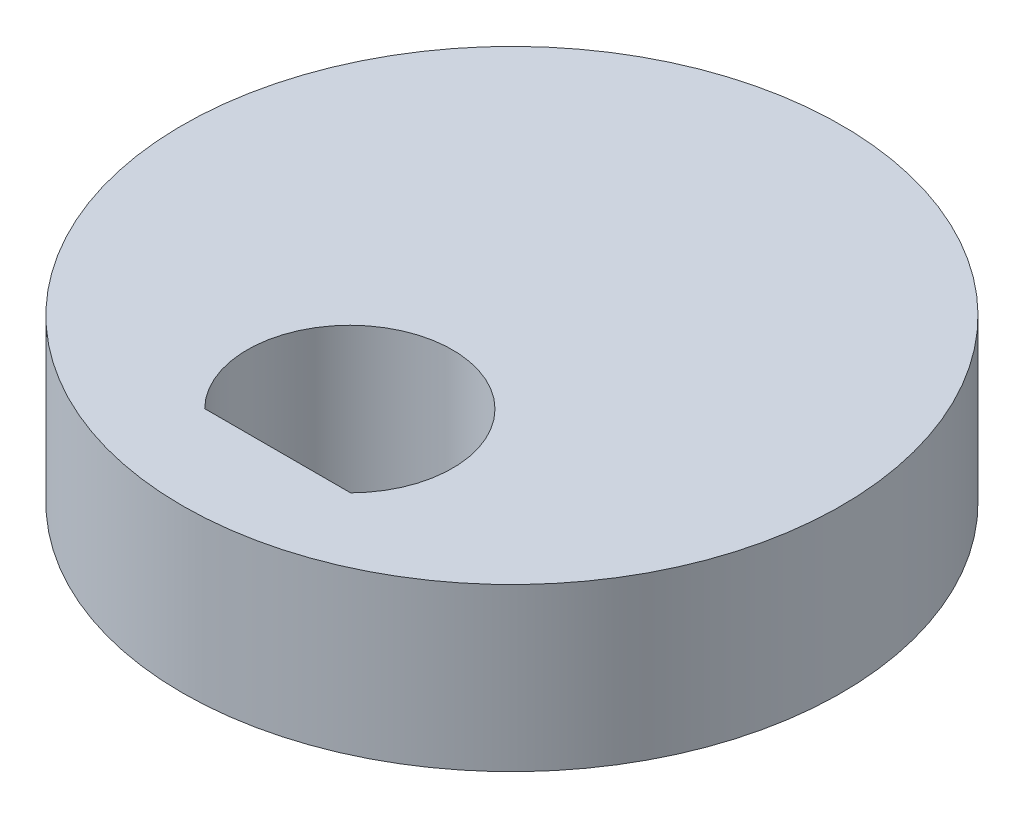
ISO-10303-21;
HEADER;
FILE_DESCRIPTION(('STEP AP214'),'2;1');
FILE_NAME('part.step','',(''),(''),'','','');
FILE_SCHEMA(('AUTOMOTIVE_DESIGN { 1 0 10303 214 1 1 1 1 }'));
ENDSEC;
DATA;
#1=APPLICATION_CONTEXT('core data for automotive mechanical design processes');
#2=APPLICATION_PROTOCOL_DEFINITION('international standard','automotive_design',2000,#1);
#3=PRODUCT_CONTEXT('',#1,'mechanical');
#4=PRODUCT('Part','Part','',(#3));
#5=PRODUCT_RELATED_PRODUCT_CATEGORY('part','',(#4));
#6=PRODUCT_DEFINITION_FORMATION('','',#4);
#7=PRODUCT_DEFINITION_CONTEXT('part definition',#1,'design');
#8=PRODUCT_DEFINITION('design','',#6,#7);
#9=PRODUCT_DEFINITION_SHAPE('','',#8);
#10=(LENGTH_UNIT() NAMED_UNIT(*) SI_UNIT(.MILLI.,.METRE.));
#11=(NAMED_UNIT(*) PLANE_ANGLE_UNIT() SI_UNIT($,.RADIAN.));
#12=(NAMED_UNIT(*) SI_UNIT($,.STERADIAN.) SOLID_ANGLE_UNIT());
#13=UNCERTAINTY_MEASURE_WITH_UNIT(LENGTH_MEASURE(1.E-05),#10,'distance_accuracy_value','');
#14=(GEOMETRIC_REPRESENTATION_CONTEXT(3) GLOBAL_UNCERTAINTY_ASSIGNED_CONTEXT((#13)) GLOBAL_UNIT_ASSIGNED_CONTEXT((#10,
#11,#12)) REPRESENTATION_CONTEXT('',''));
#15=CARTESIAN_POINT('',(0.,0.,0.));
#16=DIRECTION('',(0.,0.,1.));
#17=DIRECTION('',(1.,0.,0.));
#18=AXIS2_PLACEMENT_3D('',#15,#16,#17);
#19=CARTESIAN_POINT('',(0.,3.,0.));
#20=DIRECTION('',(0.,1.,0.));
#21=DIRECTION('',(0.,0.,1.));
#22=AXIS2_PLACEMENT_3D('',#19,#20,#21);
#23=PLANE('',#22);
#24=CARTESIAN_POINT('',(0.,3.,0.));
#25=DIRECTION('',(0.,1.,0.));
#26=DIRECTION('',(0.,0.,1.));
#27=AXIS2_PLACEMENT_3D('',#24,#25,#26);
#28=CIRCLE('',#27,6.1);
#29=CARTESIAN_POINT('',(0.,3.,6.1));
#30=VERTEX_POINT('',#29);
#31=EDGE_CURVE('E11',#30,#30,#28,.T.);
#32=ORIENTED_EDGE('',*,*,#31,.T.);
#33=EDGE_LOOP('',(#32));
#34=FACE_BOUND('',#33,.T.);
#35=DIRECTION('',(1.,0.,0.));
#36=VECTOR('',#35,1.);
#37=CARTESIAN_POINT('',(1.35,3.,4.33697419571209));
#38=LINE('',#37,#36);
#39=CARTESIAN_POINT('',(-1.35,3.,4.33697419571209));
#40=VERTEX_POINT('',#39);
#41=CARTESIAN_POINT('',(1.35,3.,4.33697419571209));
#42=VERTEX_POINT('',#41);
#43=EDGE_CURVE('E89',#40,#42,#38,.T.);
#44=ORIENTED_EDGE('',*,*,#43,.F.);
#45=CARTESIAN_POINT('',(0.,3.,3.));
#46=DIRECTION('',(0.,1.,0.));
#47=DIRECTION('',(0.,0.,1.));
#48=AXIS2_PLACEMENT_3D('',#45,#46,#47);
#49=CIRCLE('',#48,1.9);
#50=EDGE_CURVE('E78',#42,#40,#49,.T.);
#51=ORIENTED_EDGE('',*,*,#50,.F.);
#52=EDGE_LOOP('',(#44,#51));
#53=FACE_BOUND('',#52,.T.);
#54=ADVANCED_FACE('F44',(#34,#53),#23,.T.);
#55=CARTESIAN_POINT('',(0.,0.,0.));
#56=DIRECTION('',(0.,1.,0.));
#57=DIRECTION('',(0.,0.,1.));
#58=AXIS2_PLACEMENT_3D('',#55,#56,#57);
#59=PLANE('',#58);
#60=CARTESIAN_POINT('',(0.,0.,0.));
#61=DIRECTION('',(0.,1.,0.));
#62=DIRECTION('',(0.,0.,1.));
#63=AXIS2_PLACEMENT_3D('',#60,#61,#62);
#64=CIRCLE('',#63,6.1);
#65=CARTESIAN_POINT('',(0.,0.,6.1));
#66=VERTEX_POINT('',#65);
#67=EDGE_CURVE('E48',#66,#66,#64,.T.);
#68=ORIENTED_EDGE('',*,*,#67,.F.);
#69=EDGE_LOOP('',(#68));
#70=FACE_BOUND('',#69,.T.);
#71=CARTESIAN_POINT('',(0.,0.,3.));
#72=DIRECTION('',(0.,1.,0.));
#73=DIRECTION('',(0.,0.,1.));
#74=AXIS2_PLACEMENT_3D('',#71,#72,#73);
#75=CIRCLE('',#74,1.9);
#76=CARTESIAN_POINT('',(1.35,0.,4.33697419571209));
#77=VERTEX_POINT('',#76);
#78=CARTESIAN_POINT('',(-1.35,0.,4.33697419571209));
#79=VERTEX_POINT('',#78);
#80=EDGE_CURVE('E67',#77,#79,#75,.T.);
#81=ORIENTED_EDGE('',*,*,#80,.T.);
#82=DIRECTION('',(1.,0.,0.));
#83=VECTOR('',#82,1.);
#84=CARTESIAN_POINT('',(1.35,0.,4.33697419571209));
#85=LINE('',#84,#83);
#86=EDGE_CURVE('E73',#79,#77,#85,.T.);
#87=ORIENTED_EDGE('',*,*,#86,.T.);
#88=EDGE_LOOP('',(#81,#87));
#89=FACE_BOUND('',#88,.T.);
#90=ADVANCED_FACE('F85',(#70,#89),#59,.F.);
#91=CARTESIAN_POINT('',(0.,3.,0.));
#92=DIRECTION('',(0.,-1.,0.));
#93=DIRECTION('',(0.,0.,-1.));
#94=AXIS2_PLACEMENT_3D('',#91,#92,#93);
#95=CYLINDRICAL_SURFACE('',#94,6.1);
#96=ORIENTED_EDGE('',*,*,#31,.F.);
#97=EDGE_LOOP('',(#96));
#98=FACE_BOUND('',#97,.T.);
#99=ORIENTED_EDGE('',*,*,#67,.T.);
#100=EDGE_LOOP('',(#99));
#101=FACE_BOUND('',#100,.T.);
#102=ADVANCED_FACE('F46',(#98,#101),#95,.T.);
#103=CARTESIAN_POINT('',(0.,3.,3.));
#104=DIRECTION('',(0.,-1.,0.));
#105=DIRECTION('',(0.,0.,-1.));
#106=AXIS2_PLACEMENT_3D('',#103,#104,#105);
#107=CYLINDRICAL_SURFACE('',#106,1.9);
#108=ORIENTED_EDGE('',*,*,#80,.F.);
#109=DIRECTION('',(0.,-1.,0.));
#110=VECTOR('',#109,1.);
#111=CARTESIAN_POINT('',(1.35,3.,4.33697419571209));
#112=LINE('',#111,#110);
#113=EDGE_CURVE('E75',#42,#77,#112,.T.);
#114=ORIENTED_EDGE('',*,*,#113,.F.);
#115=ORIENTED_EDGE('',*,*,#50,.T.);
#116=DIRECTION('',(0.,-1.,0.));
#117=VECTOR('',#116,1.);
#118=CARTESIAN_POINT('',(-1.35,3.,4.33697419571209));
#119=LINE('',#118,#117);
#120=EDGE_CURVE('E60',#40,#79,#119,.T.);
#121=ORIENTED_EDGE('',*,*,#120,.T.);
#122=EDGE_LOOP('',(#108,#114,#115,#121));
#123=FACE_BOUND('',#122,.T.);
#124=ADVANCED_FACE('F80',(#123),#107,.F.);
#125=CARTESIAN_POINT('',(1.35,3.,4.33697419571209));
#126=DIRECTION('',(0.,0.,-1.));
#127=DIRECTION('',(-1.,0.,0.));
#128=AXIS2_PLACEMENT_3D('',#125,#126,#127);
#129=PLANE('',#128);
#130=ORIENTED_EDGE('',*,*,#86,.F.);
#131=ORIENTED_EDGE('',*,*,#120,.F.);
#132=ORIENTED_EDGE('',*,*,#43,.T.);
#133=ORIENTED_EDGE('',*,*,#113,.T.);
#134=EDGE_LOOP('',(#130,#131,#132,#133));
#135=FACE_BOUND('',#134,.T.);
#136=ADVANCED_FACE('F74',(#135),#129,.T.);
#137=CLOSED_SHELL('',(#54,#90,#102,#124,#136));
#138=MANIFOLD_SOLID_BREP('B2',#137);
#139=ADVANCED_BREP_SHAPE_REPRESENTATION('',(#18,#138),#14);
#140=SHAPE_DEFINITION_REPRESENTATION(#9,#139);
ENDSEC;
END-ISO-10303-21;
